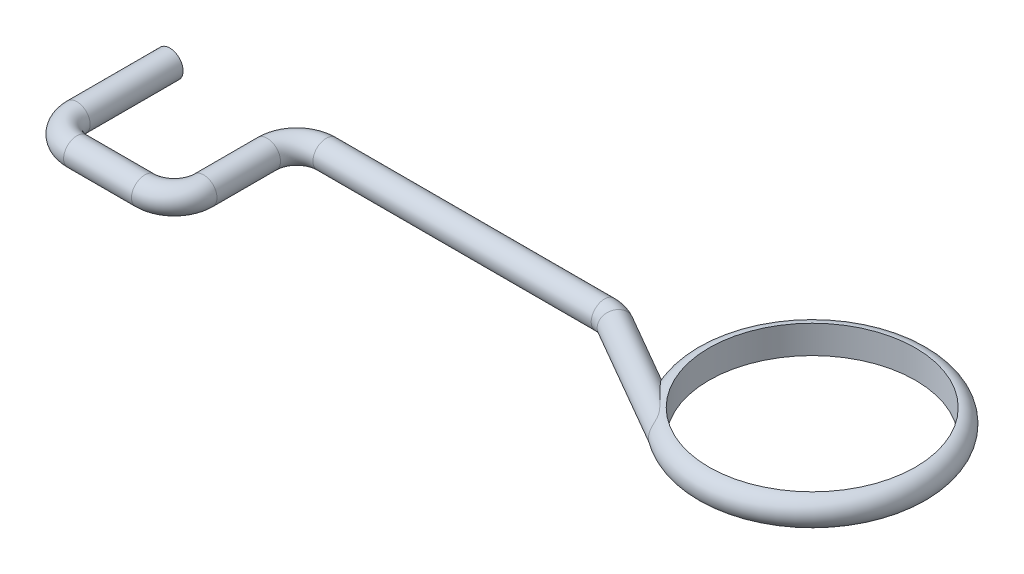
ISO-10303-21;
HEADER;
FILE_DESCRIPTION(('STEP AP214'),'2;1');
FILE_NAME('part.step','',(''),(''),'','','');
FILE_SCHEMA(('AUTOMOTIVE_DESIGN { 1 0 10303 214 1 1 1 1 }'));
ENDSEC;
DATA;
#1=APPLICATION_CONTEXT('core data for automotive mechanical design processes');
#2=APPLICATION_PROTOCOL_DEFINITION('international standard','automotive_design',2000,#1);
#3=PRODUCT_CONTEXT('',#1,'mechanical');
#4=PRODUCT('Part','Part','',(#3));
#5=PRODUCT_RELATED_PRODUCT_CATEGORY('part','',(#4));
#6=PRODUCT_DEFINITION_FORMATION('','',#4);
#7=PRODUCT_DEFINITION_CONTEXT('part definition',#1,'design');
#8=PRODUCT_DEFINITION('design','',#6,#7);
#9=PRODUCT_DEFINITION_SHAPE('','',#8);
#10=(LENGTH_UNIT() NAMED_UNIT(*) SI_UNIT(.MILLI.,.METRE.));
#11=(NAMED_UNIT(*) PLANE_ANGLE_UNIT() SI_UNIT($,.RADIAN.));
#12=(NAMED_UNIT(*) SI_UNIT($,.STERADIAN.) SOLID_ANGLE_UNIT());
#13=UNCERTAINTY_MEASURE_WITH_UNIT(LENGTH_MEASURE(1.E-05),#10,'distance_accuracy_value','');
#14=(GEOMETRIC_REPRESENTATION_CONTEXT(3) GLOBAL_UNCERTAINTY_ASSIGNED_CONTEXT((#13)) GLOBAL_UNIT_ASSIGNED_CONTEXT((#10,
#11,#12)) REPRESENTATION_CONTEXT('',''));
#15=CARTESIAN_POINT('',(0.,0.,0.));
#16=DIRECTION('',(0.,0.,1.));
#17=DIRECTION('',(1.,0.,0.));
#18=AXIS2_PLACEMENT_3D('',#15,#16,#17);
#19=CARTESIAN_POINT('',(7.73788181024499,0.,0.0680590948775048));
#20=DIRECTION('',(0.866025403784439,0.,0.5));
#21=DIRECTION('',(0.5,0.,-0.866025403784439));
#22=AXIS2_PLACEMENT_3D('',#19,#20,#21);
#23=CYLINDRICAL_SURFACE('',#22,0.2286);
#24=CARTESIAN_POINT('',(7.73788181024499,0.,0.0680590948775048));
#25=DIRECTION('',(-0.866025403784446,0.,-0.499999999999987));
#26=DIRECTION('',(-0.499999999999987,0.,0.866025403784446));
#27=AXIS2_PLACEMENT_3D('',#24,#25,#26);
#28=CIRCLE('',#27,0.2286);
#29=CARTESIAN_POINT('',(7.85218181024499,0.,-0.129914312427618));
#30=VERTEX_POINT('',#29);
#31=EDGE_CURVE('E43',#30,#30,#28,.T.);
#32=ORIENTED_EDGE('',*,*,#31,.F.);
#33=EDGE_LOOP('',(#32));
#34=FACE_BOUND('',#33,.T.);
#35=CARTESIAN_POINT('',(9.00907745547446,0.,0.538019699769918));
#36=CARTESIAN_POINT('',(9.00907438189345,0.00505048044958493,0.538015867889766));
#37=CARTESIAN_POINT('',(9.00938313992504,0.0100945269372364,0.538390912183663));
#38=CARTESIAN_POINT('',(9.01057281713873,0.0200164200859555,0.5398345044829));
#39=CARTESIAN_POINT('',(9.01145447234306,0.0248940444421554,0.540903944602986));
#40=CARTESIAN_POINT('',(9.01535159785965,0.0412589146184882,0.545624007029282));
#41=CARTESIAN_POINT('',(9.01960409027962,0.0520162369923135,0.550764751582315));
#42=CARTESIAN_POINT('',(9.02877713635075,0.0697331770310692,0.561785366217871));
#43=CARTESIAN_POINT('',(9.03346071398062,0.077027550975609,0.567390419097597));
#44=CARTESIAN_POINT('',(9.04348267011727,0.0905235730831773,0.579319095876287));
#45=CARTESIAN_POINT('',(9.04882250769738,0.096722708841123,0.585644318558432));
#46=CARTESIAN_POINT('',(9.06162168175843,0.109997770430755,0.600717898930234));
#47=CARTESIAN_POINT('',(9.06922775166917,0.116756896523558,0.609613158527365));
#48=CARTESIAN_POINT('',(9.08487644480316,0.129134666885532,0.627770139765763));
#49=CARTESIAN_POINT('',(9.09291880705455,0.13475398361218,0.637031641456858));
#50=CARTESIAN_POINT('',(9.11757719637865,0.150349077527354,0.665199990691631));
#51=CARTESIAN_POINT('',(9.13466245933169,0.159005245891984,0.684417339380232));
#52=CARTESIAN_POINT('',(9.17879908034472,0.178027352527497,0.733256190652161));
#53=CARTESIAN_POINT('',(9.2063352622873,0.18686982516016,0.762996242724914));
#54=CARTESIAN_POINT('',(9.26250495103164,0.201322342890297,0.822276097957555));
#55=CARTESIAN_POINT('',(9.29114063357347,0.206925584894793,0.851815351826348));
#56=CARTESIAN_POINT('',(9.34931310839124,0.215950850443215,0.910747508419869));
#57=CARTESIAN_POINT('',(9.37885495060993,0.219356662625593,0.940137771219464));
#58=CARTESIAN_POINT('',(9.43818750016776,0.224556305744472,0.998719335132695));
#59=CARTESIAN_POINT('',(9.46797781044112,0.22635234197506,1.02791085390294));
#60=CARTESIAN_POINT('',(9.51287302080532,0.228007178882357,1.07279067309979));
#61=CARTESIAN_POINT('',(9.52818278874608,0.228381741920162,1.08825520841008));
#62=CARTESIAN_POINT('',(9.55842935289921,0.228680226730793,1.11961563152171));
#63=CARTESIAN_POINT('',(9.57336536313253,0.228603267839062,1.13551230205848));
#64=CARTESIAN_POINT('',(9.60223566702526,0.227800330001291,1.16785482961495));
#65=CARTESIAN_POINT('',(9.61617960417465,0.227081923225638,1.18429213016953));
#66=CARTESIAN_POINT('',(9.64244071094073,0.224507526890148,1.21831174497204));
#67=CARTESIAN_POINT('',(9.65476417718754,0.222656108711784,1.23588920549834));
#68=CARTESIAN_POINT('',(9.67255799220392,0.217741445641317,1.26581398792836));
#69=CARTESIAN_POINT('',(9.67889217136047,0.215362053897305,1.27774368419711));
#70=CARTESIAN_POINT('',(9.68998165717942,0.209192434774637,1.30197198404355));
#71=CARTESIAN_POINT('',(9.69473952187004,0.205404514559156,1.3142699542673));
#72=CARTESIAN_POINT('',(9.70253669957748,0.195904801062317,1.3388711223049));
#73=CARTESIAN_POINT('',(9.70555498313359,0.190170745287576,1.35117265569909));
#74=CARTESIAN_POINT('',(9.70998722113384,0.17654559468709,1.37485745601217));
#75=CARTESIAN_POINT('',(9.71139997618024,0.168652892714782,1.38624003054101));
#76=CARTESIAN_POINT('',(9.71299489964784,0.152179176204024,1.40574566137325));
#77=CARTESIAN_POINT('',(9.71333150121975,0.143885231741657,1.41410117534979));
#78=CARTESIAN_POINT('',(9.71354970403597,0.126020412437977,1.42931439571602));
#79=CARTESIAN_POINT('',(9.71343145033981,0.116449945636803,1.43617257888769));
#80=CARTESIAN_POINT('',(9.71302124894539,0.096442637006408,1.44807950092799));
#81=CARTESIAN_POINT('',(9.71273197322258,0.0860212046538616,1.45315419951398));
#82=CARTESIAN_POINT('',(9.71216959978106,0.0644761909479373,1.46150745831698));
#83=CARTESIAN_POINT('',(9.7118965251953,0.0533516503097893,1.46478350286451));
#84=CARTESIAN_POINT('',(9.71129776489999,0.019203093224761,1.471791975445));
#85=CARTESIAN_POINT('',(9.71119775626356,-0.00448593232885968,1.47264035959088));
#86=CARTESIAN_POINT('',(9.71176468786788,-0.0508355404799592,1.46644422492934));
#87=CARTESIAN_POINT('',(9.71243275563397,-0.0734945602278373,1.45938810280816));
#88=CARTESIAN_POINT('',(9.71320322842551,-0.10471347245252,1.4435339099322));
#89=CARTESIAN_POINT('',(9.7134216387398,-0.114674245511908,1.437354267138));
#90=CARTESIAN_POINT('',(9.71352128474498,-0.133420604109689,1.42342063241818));
#91=CARTESIAN_POINT('',(9.7134030314266,-0.142207949483085,1.41566904299875));
#92=CARTESIAN_POINT('',(9.7125253754897,-0.158339186009022,1.39891074639263));
#93=CARTESIAN_POINT('',(9.71176986344052,-0.165691503584424,1.38991193169539));
#94=CARTESIAN_POINT('',(9.70929803171444,-0.178897839108437,1.37099660887636));
#95=CARTESIAN_POINT('',(9.70758193315835,-0.184752201424931,1.36108031239129));
#96=CARTESIAN_POINT('',(9.70296710078819,-0.194940742856284,1.34087369409521));
#97=CARTESIAN_POINT('',(9.70007888699821,-0.199287822779157,1.33058742255428));
#98=CARTESIAN_POINT('',(9.69307264931627,-0.206707215826084,1.30999726043217));
#99=CARTESIAN_POINT('',(9.68895548352594,-0.209780414858059,1.29969338711621));
#100=CARTESIAN_POINT('',(9.67656397666599,-0.216628225590679,1.27271918481009));
#101=CARTESIAN_POINT('',(9.66732962614789,-0.219553060456627,1.25627957460169));
#102=CARTESIAN_POINT('',(9.65196961697527,-0.222802717024167,1.23244350198926));
#103=CARTESIAN_POINT('',(9.64657426239826,-0.22369756828635,1.22460654635588));
#104=CARTESIAN_POINT('',(9.63539795918978,-0.225199187210924,1.20918403289176));
#105=CARTESIAN_POINT('',(9.62961714658694,-0.225806055895469,1.20159838777303));
#106=CARTESIAN_POINT('',(9.61477761985145,-0.227061482560592,1.18287616536486));
#107=CARTESIAN_POINT('',(9.60553584963681,-0.227576766275632,1.17187773709219));
#108=CARTESIAN_POINT('',(9.58662762069237,-0.228286937788371,1.1502389091182));
#109=CARTESIAN_POINT('',(9.5769609764761,-0.228481684194187,1.13959866944312));
#110=CARTESIAN_POINT('',(9.54752685008362,-0.228719589760326,1.10799475999546));
#111=CARTESIAN_POINT('',(9.52736690121897,-0.228413977322953,1.08739740452744));
#112=CARTESIAN_POINT('',(9.48668281991347,-0.22712083438657,1.04653461012788));
#113=CARTESIAN_POINT('',(9.46615815994623,-0.226132221679133,1.02626975027546));
#114=CARTESIAN_POINT('',(9.42512630411319,-0.223446752851707,0.985810140497382));
#115=CARTESIAN_POINT('',(9.40461911291461,-0.221750651777754,0.965615338903016));
#116=CARTESIAN_POINT('',(9.36383468289405,-0.217521989207983,0.925153585776472));
#117=CARTESIAN_POINT('',(9.3435570944776,-0.214990950317104,0.904886831522777));
#118=CARTESIAN_POINT('',(9.30334016778825,-0.208875044317939,0.864199186909784));
#119=CARTESIAN_POINT('',(9.283400602806,-0.20529091568693,0.843778414300063));
#120=CARTESIAN_POINT('',(9.24807788626343,-0.197635315202939,0.807062453351248));
#121=CARTESIAN_POINT('',(9.23261139528784,-0.193821188089357,0.790794648290647));
#122=CARTESIAN_POINT('',(9.20201391226278,-0.185093074622168,0.758200674101749));
#123=CARTESIAN_POINT('',(9.18688327132059,-0.180177991800648,0.741874462867194));
#124=CARTESIAN_POINT('',(9.15581915550456,-0.168438830162546,0.707909028398527));
#125=CARTESIAN_POINT('',(9.13992575722683,-0.161488610241235,0.690275329567372));
#126=CARTESIAN_POINT('',(9.10896363722153,-0.145246580527587,0.655422814417855));
#127=CARTESIAN_POINT('',(9.09389261616819,-0.135961754696977,0.638202925594477));
#128=CARTESIAN_POINT('',(9.06836283168306,-0.116267104366888,0.608627612549481));
#129=CARTESIAN_POINT('',(9.05763250452256,-0.106588268852808,0.596053720410111));
#130=CARTESIAN_POINT('',(9.04272655524391,-0.0895197352804063,0.578421981470449));
#131=CARTESIAN_POINT('',(9.03793251303481,-0.0833630168459474,0.572720925046774));
#132=CARTESIAN_POINT('',(9.02902686372146,-0.0700053608505427,0.562085272720269));
#133=CARTESIAN_POINT('',(9.02491300961175,-0.0628080149758971,0.557148156750113));
#134=CARTESIAN_POINT('',(9.01734492597524,-0.0462159084023097,0.548035682952217));
#135=CARTESIAN_POINT('',(9.01402225661913,-0.0366631974816834,0.544014753884473));
#136=CARTESIAN_POINT('',(9.01006899033765,-0.0179327270422502,0.539224762762304));
#137=CARTESIAN_POINT('',(9.00908290599558,-0.00895624690622854,0.53802649501744));
#138=CARTESIAN_POINT('',(9.00907745547446,0.,0.538019699769918));
#139=B_SPLINE_CURVE_WITH_KNOTS('',3,(#35,#36,#37,#38,#39,#40,#41,#42,#43,#44,#45,#46,#47,#48,
#49,#50,#51,#52,#53,#54,#55,#56,#57,#58,#59,#60,#61,#62,#63,#64,#65,#66,#67,#68,#69,#70,#71,#72,
#73,#74,#75,#76,#77,#78,#79,#80,#81,#82,#83,#84,#85,#86,#87,#88,#89,#90,#91,#92,#93,#94,#95,#96,
#97,#98,#99,#100,#101,#102,#103,#104,#105,#106,#107,#108,#109,#110,#111,#112,#113,#114,#115,
#116,#117,#118,#119,#120,#121,#122,#123,#124,#125,#126,#127,#128,#129,#130,#131,#132,#133,#134,
#135,#136,#137,#138),.UNSPECIFIED.,.T.,.F.,(4,2,2,2,2,2,2,2,2,2,2,2,2,2,2,2,2,2,2,2,2,2,2,2,2,2,
2,2,2,2,2,2,2,2,2,2,2,2,2,2,2,2,2,2,2,2,2,2,2,2,2,4),(0.,0.0151187008053176,0.0302568636723049,
0.0674626364330102,0.0983344808898913,0.129276248961318,0.169735199448446,0.210170210345529,
0.29137145657005,0.415588974788238,0.540066437961636,0.665452029411598,0.790665586598834,
0.855953186906473,0.921368168768245,0.986021001592306,1.05041468272661,1.09143344428027,
1.13238531115348,1.17382237965266,1.21529038308907,1.25045399331736,1.28560639032092,
1.32022357760723,1.35488905933023,1.42458410442588,1.49438159164375,1.52941204352657,
1.56438935427047,1.59915465559616,1.63391195746289,1.6683639699869,1.7027919828372,
1.75967402231237,1.78833864865745,1.81699321221719,1.86009627515144,1.9032183461427,
1.98965646932691,2.07623186808385,2.1627151072476,2.24904149819237,2.33530749680531,
2.40359036289039,2.47194153827383,2.54606369028142,2.61996669080941,2.67713281983878,
2.70604450924243,2.73485869311396,2.7670097442797,2.79382042470218),.UNSPECIFIED.);
#140=CARTESIAN_POINT('',(9.00907745547446,0.,0.538019699769918));
#141=VERTEX_POINT('',#140);
#142=EDGE_CURVE('E10',#141,#141,#139,.T.);
#143=ORIENTED_EDGE('',*,*,#142,.F.);
#144=EDGE_LOOP('',(#143));
#145=FACE_BOUND('',#144,.T.);
#146=ADVANCED_FACE('F33',(#34,#145),#23,.T.);
#147=CARTESIAN_POINT('',(7.48388181024499,0.,0.508));
#148=DIRECTION('',(0.,-1.,0.));
#149=DIRECTION('',(0.,0.,-1.));
#150=AXIS2_PLACEMENT_3D('',#147,#148,#149);
#151=TOROIDAL_SURFACE('',#150,0.508000000000001,0.2286);
#152=CARTESIAN_POINT('',(7.48388181024499,0.,0.));
#153=DIRECTION('',(-1.,0.,0.));
#154=DIRECTION('',(0.,0.,1.));
#155=AXIS2_PLACEMENT_3D('',#152,#153,#154);
#156=CIRCLE('',#155,0.2286);
#157=CARTESIAN_POINT('',(7.48388181024499,0.,-0.2286));
#158=VERTEX_POINT('',#157);
#159=EDGE_CURVE('E47',#158,#158,#156,.T.);
#160=CARTESIAN_POINT('',(7.48388181024499,0.,0.508));
#161=DIRECTION('',(0.,-1.,0.));
#162=DIRECTION('',(0.,0.,-1.));
#163=AXIS2_PLACEMENT_3D('',#160,#161,#162);
#164=CIRCLE('',#163,0.7366);
#165=EDGE_CURVE('',#158,#30,#164,.T.);
#166=ORIENTED_EDGE('',*,*,#159,.F.);
#167=ORIENTED_EDGE('',*,*,#31,.T.);
#168=ORIENTED_EDGE('',*,*,#165,.T.);
#169=ORIENTED_EDGE('',*,*,#165,.F.);
#170=EDGE_LOOP('',(#166,#168,#167,#169));
#171=FACE_BOUND('',#170,.T.);
#172=ADVANCED_FACE('F118',(#171),#151,.T.);
#173=CARTESIAN_POINT('',(2.6924,0.,0.));
#174=DIRECTION('',(1.,0.,0.));
#175=DIRECTION('',(0.,0.,-1.));
#176=AXIS2_PLACEMENT_3D('',#173,#174,#175);
#177=CYLINDRICAL_SURFACE('',#176,0.2286);
#178=CARTESIAN_POINT('',(2.6924,0.,0.));
#179=DIRECTION('',(-1.,0.,0.));
#180=DIRECTION('',(0.,0.,1.));
#181=AXIS2_PLACEMENT_3D('',#178,#179,#180);
#182=CIRCLE('',#181,0.2286);
#183=CARTESIAN_POINT('',(2.6924,0.,-0.2286));
#184=VERTEX_POINT('',#183);
#185=EDGE_CURVE('E51',#184,#184,#182,.T.);
#186=ORIENTED_EDGE('',*,*,#185,.F.);
#187=EDGE_LOOP('',(#186));
#188=FACE_BOUND('',#187,.T.);
#189=ORIENTED_EDGE('',*,*,#159,.T.);
#190=EDGE_LOOP('',(#189));
#191=FACE_BOUND('',#190,.T.);
#192=ADVANCED_FACE('F115',(#188,#191),#177,.T.);
#193=CARTESIAN_POINT('',(2.6924,0.,0.508));
#194=DIRECTION('',(0.,-1.,0.));
#195=DIRECTION('',(0.,0.,-1.));
#196=AXIS2_PLACEMENT_3D('',#193,#194,#195);
#197=TOROIDAL_SURFACE('',#196,0.508,0.2286);
#198=CARTESIAN_POINT('',(2.1844,0.,0.508));
#199=DIRECTION('',(0.,0.,1.));
#200=DIRECTION('',(1.,0.,0.));
#201=AXIS2_PLACEMENT_3D('',#198,#199,#200);
#202=CIRCLE('',#201,0.2286);
#203=CARTESIAN_POINT('',(1.9558,0.,0.508));
#204=VERTEX_POINT('',#203);
#205=EDGE_CURVE('E56',#204,#204,#202,.T.);
#206=CARTESIAN_POINT('',(2.6924,0.,0.508));
#207=DIRECTION('',(0.,-1.,0.));
#208=DIRECTION('',(0.,0.,-1.));
#209=AXIS2_PLACEMENT_3D('',#206,#207,#208);
#210=CIRCLE('',#209,0.7366);
#211=EDGE_CURVE('',#204,#184,#210,.T.);
#212=ORIENTED_EDGE('',*,*,#205,.F.);
#213=ORIENTED_EDGE('',*,*,#185,.T.);
#214=ORIENTED_EDGE('',*,*,#211,.T.);
#215=ORIENTED_EDGE('',*,*,#211,.F.);
#216=EDGE_LOOP('',(#212,#214,#213,#215));
#217=FACE_BOUND('',#216,.T.);
#218=ADVANCED_FACE('F111',(#217),#197,.T.);
#219=CARTESIAN_POINT('',(2.1844,0.,1.6002));
#220=DIRECTION('',(0.,0.,-1.));
#221=DIRECTION('',(-1.,0.,0.));
#222=AXIS2_PLACEMENT_3D('',#219,#220,#221);
#223=CYLINDRICAL_SURFACE('',#222,0.2286);
#224=CARTESIAN_POINT('',(2.1844,0.,1.6002));
#225=DIRECTION('',(0.,0.,1.));
#226=DIRECTION('',(1.,0.,0.));
#227=AXIS2_PLACEMENT_3D('',#224,#225,#226);
#228=CIRCLE('',#227,0.2286);
#229=CARTESIAN_POINT('',(2.413,0.,1.60019999999999));
#230=VERTEX_POINT('',#229);
#231=EDGE_CURVE('E59',#230,#230,#228,.T.);
#232=ORIENTED_EDGE('',*,*,#231,.F.);
#233=EDGE_LOOP('',(#232));
#234=FACE_BOUND('',#233,.T.);
#235=ORIENTED_EDGE('',*,*,#205,.T.);
#236=EDGE_LOOP('',(#235));
#237=FACE_BOUND('',#236,.T.);
#238=ADVANCED_FACE('F107',(#234,#237),#223,.T.);
#239=CARTESIAN_POINT('',(1.6764,0.,1.6002));
#240=DIRECTION('',(0.,1.,0.));
#241=DIRECTION('',(0.,0.,1.));
#242=AXIS2_PLACEMENT_3D('',#239,#240,#241);
#243=TOROIDAL_SURFACE('',#242,0.508,0.2286);
#244=CARTESIAN_POINT('',(1.6764,0.,2.1082));
#245=DIRECTION('',(-1.,0.,0.));
#246=DIRECTION('',(0.,0.,1.));
#247=AXIS2_PLACEMENT_3D('',#244,#245,#246);
#248=CIRCLE('',#247,0.2286);
#249=CARTESIAN_POINT('',(1.6764,0.,2.3368));
#250=VERTEX_POINT('',#249);
#251=EDGE_CURVE('E62',#250,#250,#248,.T.);
#252=CARTESIAN_POINT('',(1.6764,0.,1.6002));
#253=DIRECTION('',(0.,1.,0.));
#254=DIRECTION('',(0.,0.,1.));
#255=AXIS2_PLACEMENT_3D('',#252,#253,#254);
#256=CIRCLE('',#255,0.7366);
#257=EDGE_CURVE('',#250,#230,#256,.T.);
#258=ORIENTED_EDGE('',*,*,#251,.F.);
#259=ORIENTED_EDGE('',*,*,#231,.T.);
#260=ORIENTED_EDGE('',*,*,#257,.T.);
#261=ORIENTED_EDGE('',*,*,#257,.F.);
#262=EDGE_LOOP('',(#258,#260,#259,#261));
#263=FACE_BOUND('',#262,.T.);
#264=ADVANCED_FACE('F103',(#263),#243,.T.);
#265=CARTESIAN_POINT('',(0.508,0.,2.1082));
#266=DIRECTION('',(1.,0.,0.));
#267=DIRECTION('',(0.,0.,-1.));
#268=AXIS2_PLACEMENT_3D('',#265,#266,#267);
#269=CYLINDRICAL_SURFACE('',#268,0.2286);
#270=CARTESIAN_POINT('',(0.508,0.,2.1082));
#271=DIRECTION('',(-1.,0.,0.));
#272=DIRECTION('',(0.,0.,1.));
#273=AXIS2_PLACEMENT_3D('',#270,#271,#272);
#274=CIRCLE('',#273,0.2286);
#275=CARTESIAN_POINT('',(0.508,0.,2.3368));
#276=VERTEX_POINT('',#275);
#277=EDGE_CURVE('E65',#276,#276,#274,.T.);
#278=ORIENTED_EDGE('',*,*,#277,.F.);
#279=EDGE_LOOP('',(#278));
#280=FACE_BOUND('',#279,.T.);
#281=ORIENTED_EDGE('',*,*,#251,.T.);
#282=EDGE_LOOP('',(#281));
#283=FACE_BOUND('',#282,.T.);
#284=ADVANCED_FACE('F99',(#280,#283),#269,.T.);
#285=CARTESIAN_POINT('',(0.508,0.,1.6002));
#286=DIRECTION('',(0.,1.,0.));
#287=DIRECTION('',(0.,0.,1.));
#288=AXIS2_PLACEMENT_3D('',#285,#286,#287);
#289=TOROIDAL_SURFACE('',#288,0.508,0.2286);
#290=CARTESIAN_POINT('',(0.,0.,1.6002));
#291=DIRECTION('',(0.,0.,-1.));
#292=DIRECTION('',(-1.,0.,0.));
#293=AXIS2_PLACEMENT_3D('',#290,#291,#292);
#294=CIRCLE('',#293,0.2286);
#295=CARTESIAN_POINT('',(-0.2286,0.,1.60019999999999));
#296=VERTEX_POINT('',#295);
#297=EDGE_CURVE('E68',#296,#296,#294,.T.);
#298=CARTESIAN_POINT('',(0.508,0.,1.6002));
#299=DIRECTION('',(0.,1.,0.));
#300=DIRECTION('',(0.,0.,1.));
#301=AXIS2_PLACEMENT_3D('',#298,#299,#300);
#302=CIRCLE('',#301,0.7366);
#303=EDGE_CURVE('',#296,#276,#302,.T.);
#304=ORIENTED_EDGE('',*,*,#297,.F.);
#305=ORIENTED_EDGE('',*,*,#277,.T.);
#306=ORIENTED_EDGE('',*,*,#303,.T.);
#307=ORIENTED_EDGE('',*,*,#303,.F.);
#308=EDGE_LOOP('',(#304,#306,#305,#307));
#309=FACE_BOUND('',#308,.T.);
#310=ADVANCED_FACE('F95',(#309),#289,.T.);
#311=CARTESIAN_POINT('',(0.,0.,1.6002));
#312=DIRECTION('',(0.,0.,-1.));
#313=DIRECTION('',(-1.,0.,0.));
#314=AXIS2_PLACEMENT_3D('',#311,#312,#313);
#315=CYLINDRICAL_SURFACE('',#314,0.2286);
#316=ORIENTED_EDGE('',*,*,#297,.T.);
#317=EDGE_LOOP('',(#316));
#318=FACE_BOUND('',#317,.T.);
#319=CARTESIAN_POINT('',(0.,0.,0.));
#320=DIRECTION('',(0.,0.,-1.));
#321=DIRECTION('',(-1.,0.,0.));
#322=AXIS2_PLACEMENT_3D('',#319,#320,#321);
#323=CIRCLE('',#322,0.2286);
#324=CARTESIAN_POINT('',(-0.2286,0.,0.));
#325=VERTEX_POINT('',#324);
#326=EDGE_CURVE('E69',#325,#325,#323,.T.);
#327=ORIENTED_EDGE('',*,*,#326,.F.);
#328=EDGE_LOOP('',(#327));
#329=FACE_BOUND('',#328,.T.);
#330=ADVANCED_FACE('F91',(#318,#329),#315,.T.);
#331=CARTESIAN_POINT('',(0.,0.,0.));
#332=DIRECTION('',(0.,0.,-1.));
#333=DIRECTION('',(-1.,0.,0.));
#334=AXIS2_PLACEMENT_3D('',#331,#332,#333);
#335=PLANE('',#334);
#336=ORIENTED_EDGE('',*,*,#326,.T.);
#337=EDGE_LOOP('',(#336));
#338=FACE_BOUND('',#337,.T.);
#339=ADVANCED_FACE('F87',(#338),#335,.T.);
#340=CARTESIAN_POINT('',(12.6752079530536,0.,0.));
#341=DIRECTION('',(0.,0.,-1.));
#342=DIRECTION('',(-1.,0.,0.));
#343=AXIS2_PLACEMENT_3D('',#340,#341,#342);
#344=CIRCLE('',#343,0.2413);
#345=CARTESIAN_POINT('',(10.9041459832745,0.,-0.156918766252273));
#346=DIRECTION('',(0.,-1.,0.));
#347=AXIS1_PLACEMENT('',#345,#346);
#348=SURFACE_OF_REVOLUTION('',#344,#347);
#349=CARTESIAN_POINT('',(10.9041459832745,0.2413,-0.156918766252273));
#350=DIRECTION('',(0.,-1.,0.));
#351=DIRECTION('',(0.,0.,-1.));
#352=AXIS2_PLACEMENT_3D('',#349,#350,#351);
#353=CIRCLE('',#352,1.778);
#354=CARTESIAN_POINT('',(10.9041459832745,0.2413,-1.93491876625227));
#355=VERTEX_POINT('',#354);
#356=EDGE_CURVE('E77',#355,#355,#353,.T.);
#357=ORIENTED_EDGE('',*,*,#356,.T.);
#358=EDGE_LOOP('',(#357));
#359=FACE_BOUND('',#358,.T.);
#360=CARTESIAN_POINT('',(10.9041459832745,-0.2413,-0.156918766252273));
#361=DIRECTION('',(0.,-1.,0.));
#362=DIRECTION('',(0.,0.,-1.));
#363=AXIS2_PLACEMENT_3D('',#360,#361,#362);
#364=CIRCLE('',#363,1.778);
#365=CARTESIAN_POINT('',(10.9041459832745,-0.2413,-1.93491876625227));
#366=VERTEX_POINT('',#365);
#367=EDGE_CURVE('E72',#366,#366,#364,.T.);
#368=ORIENTED_EDGE('',*,*,#367,.F.);
#369=EDGE_LOOP('',(#368));
#370=FACE_BOUND('',#369,.T.);
#371=ORIENTED_EDGE('',*,*,#142,.T.);
#372=EDGE_LOOP('',(#371));
#373=FACE_BOUND('',#372,.T.);
#374=ADVANCED_FACE('F81',(#359,#370,#373),#348,.T.);
#375=CARTESIAN_POINT('',(10.9041459832745,0.,-0.156918766252273));
#376=DIRECTION('',(0.,-1.,0.));
#377=DIRECTION('',(0.,0.,-1.));
#378=AXIS2_PLACEMENT_3D('',#375,#376,#377);
#379=CYLINDRICAL_SURFACE('',#378,1.778);
#380=ORIENTED_EDGE('',*,*,#367,.T.);
#381=EDGE_LOOP('',(#380));
#382=FACE_BOUND('',#381,.T.);
#383=ORIENTED_EDGE('',*,*,#356,.F.);
#384=EDGE_LOOP('',(#383));
#385=FACE_BOUND('',#384,.T.);
#386=ADVANCED_FACE('F86',(#382,#385),#379,.F.);
#387=CLOSED_SHELL('',(#146,#172,#192,#218,#238,#264,#284,#310,#330,#339,#374,#386));
#388=MANIFOLD_SOLID_BREP('B2',#387);
#389=ADVANCED_BREP_SHAPE_REPRESENTATION('',(#18,#388),#14);
#390=SHAPE_DEFINITION_REPRESENTATION(#9,#389);
ENDSEC;
END-ISO-10303-21;
